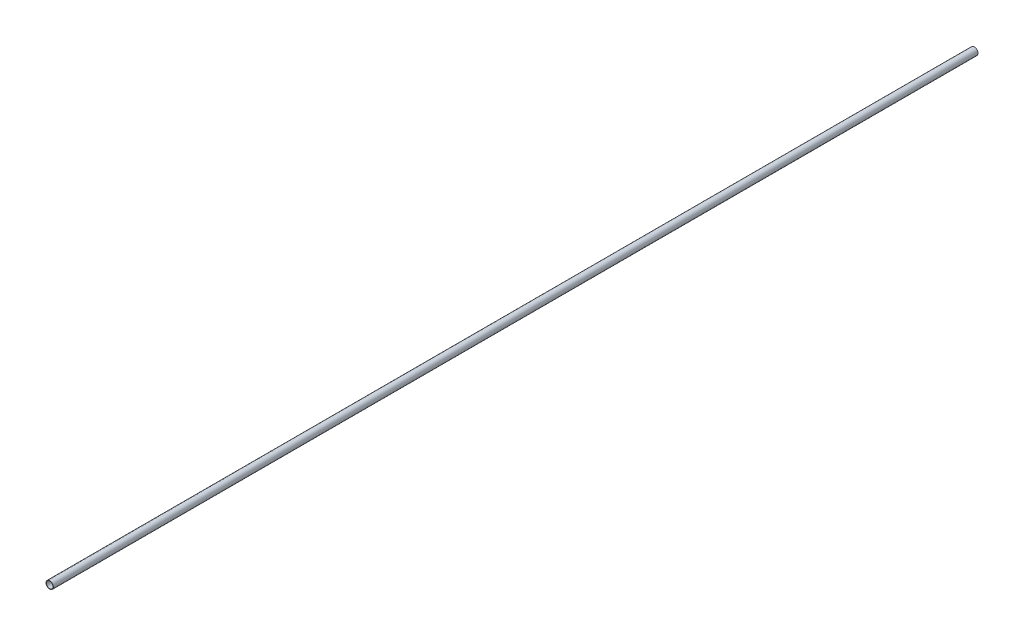
ISO-10303-21;
HEADER;
FILE_DESCRIPTION(('STEP AP214'),'2;1');
FILE_NAME('part.step','',(''),(''),'','','');
FILE_SCHEMA(('AUTOMOTIVE_DESIGN { 1 0 10303 214 1 1 1 1 }'));
ENDSEC;
DATA;
#1=APPLICATION_CONTEXT('core data for automotive mechanical design processes');
#2=APPLICATION_PROTOCOL_DEFINITION('international standard','automotive_design',2000,#1);
#3=PRODUCT_CONTEXT('',#1,'mechanical');
#4=PRODUCT('Part','Part','',(#3));
#5=PRODUCT_RELATED_PRODUCT_CATEGORY('part','',(#4));
#6=PRODUCT_DEFINITION_FORMATION('','',#4);
#7=PRODUCT_DEFINITION_CONTEXT('part definition',#1,'design');
#8=PRODUCT_DEFINITION('design','',#6,#7);
#9=PRODUCT_DEFINITION_SHAPE('','',#8);
#10=(LENGTH_UNIT() NAMED_UNIT(*) SI_UNIT(.MILLI.,.METRE.));
#11=(NAMED_UNIT(*) PLANE_ANGLE_UNIT() SI_UNIT($,.RADIAN.));
#12=(NAMED_UNIT(*) SI_UNIT($,.STERADIAN.) SOLID_ANGLE_UNIT());
#13=UNCERTAINTY_MEASURE_WITH_UNIT(LENGTH_MEASURE(1.E-05),#10,'distance_accuracy_value','');
#14=(GEOMETRIC_REPRESENTATION_CONTEXT(3) GLOBAL_UNCERTAINTY_ASSIGNED_CONTEXT((#13)) GLOBAL_UNIT_ASSIGNED_CONTEXT((#10,
#11,#12)) REPRESENTATION_CONTEXT('',''));
#15=CARTESIAN_POINT('',(0.,0.,0.));
#16=DIRECTION('',(0.,0.,1.));
#17=DIRECTION('',(1.,0.,0.));
#18=AXIS2_PLACEMENT_3D('',#15,#16,#17);
#19=CARTESIAN_POINT('',(0.,0.,1000.));
#20=DIRECTION('',(0.,0.,1.));
#21=DIRECTION('',(1.,0.,0.));
#22=AXIS2_PLACEMENT_3D('',#19,#20,#21);
#23=PLANE('',#22);
#24=CARTESIAN_POINT('',(0.,0.,1000.));
#25=DIRECTION('',(0.,0.,1.));
#26=DIRECTION('',(1.,0.,0.));
#27=AXIS2_PLACEMENT_3D('',#24,#25,#26);
#28=CIRCLE('',#27,8.);
#29=CARTESIAN_POINT('',(8.,0.,1000.));
#30=VERTEX_POINT('',#29);
#31=EDGE_CURVE('E10',#30,#30,#28,.T.);
#32=ORIENTED_EDGE('',*,*,#31,.T.);
#33=EDGE_LOOP('',(#32));
#34=FACE_BOUND('',#33,.T.);
#35=CARTESIAN_POINT('',(0.,0.,1000.));
#36=DIRECTION('',(0.,0.,1.));
#37=DIRECTION('',(1.,0.,0.));
#38=AXIS2_PLACEMENT_3D('',#35,#36,#37);
#39=CIRCLE('',#38,7.);
#40=CARTESIAN_POINT('',(7.,0.,1000.));
#41=VERTEX_POINT('',#40);
#42=EDGE_CURVE('E50',#41,#41,#39,.T.);
#43=ORIENTED_EDGE('',*,*,#42,.F.);
#44=EDGE_LOOP('',(#43));
#45=FACE_BOUND('',#44,.T.);
#46=ADVANCED_FACE('F37',(#34,#45),#23,.T.);
#47=CARTESIAN_POINT('',(0.,0.,-1000.));
#48=DIRECTION('',(0.,0.,1.));
#49=DIRECTION('',(1.,0.,0.));
#50=AXIS2_PLACEMENT_3D('',#47,#48,#49);
#51=PLANE('',#50);
#52=CARTESIAN_POINT('',(0.,0.,-1000.));
#53=DIRECTION('',(0.,0.,1.));
#54=DIRECTION('',(1.,0.,0.));
#55=AXIS2_PLACEMENT_3D('',#52,#53,#54);
#56=CIRCLE('',#55,8.);
#57=CARTESIAN_POINT('',(8.,0.,-1000.));
#58=VERTEX_POINT('',#57);
#59=EDGE_CURVE('E41',#58,#58,#56,.T.);
#60=ORIENTED_EDGE('',*,*,#59,.F.);
#61=EDGE_LOOP('',(#60));
#62=FACE_BOUND('',#61,.T.);
#63=CARTESIAN_POINT('',(0.,0.,-1000.));
#64=DIRECTION('',(0.,0.,1.));
#65=DIRECTION('',(1.,0.,0.));
#66=AXIS2_PLACEMENT_3D('',#63,#64,#65);
#67=CIRCLE('',#66,7.);
#68=CARTESIAN_POINT('',(7.,0.,-1000.));
#69=VERTEX_POINT('',#68);
#70=EDGE_CURVE('E52',#69,#69,#67,.T.);
#71=ORIENTED_EDGE('',*,*,#70,.T.);
#72=EDGE_LOOP('',(#71));
#73=FACE_BOUND('',#72,.T.);
#74=ADVANCED_FACE('F64',(#62,#73),#51,.F.);
#75=CARTESIAN_POINT('',(0.,0.,1000.));
#76=DIRECTION('',(0.,0.,-1.));
#77=DIRECTION('',(-1.,0.,0.));
#78=AXIS2_PLACEMENT_3D('',#75,#76,#77);
#79=CYLINDRICAL_SURFACE('',#78,8.);
#80=ORIENTED_EDGE('',*,*,#31,.F.);
#81=EDGE_LOOP('',(#80));
#82=FACE_BOUND('',#81,.T.);
#83=ORIENTED_EDGE('',*,*,#59,.T.);
#84=EDGE_LOOP('',(#83));
#85=FACE_BOUND('',#84,.T.);
#86=ADVANCED_FACE('F39',(#82,#85),#79,.T.);
#87=CARTESIAN_POINT('',(0.,0.,1000.));
#88=DIRECTION('',(0.,0.,-1.));
#89=DIRECTION('',(-1.,0.,0.));
#90=AXIS2_PLACEMENT_3D('',#87,#88,#89);
#91=CYLINDRICAL_SURFACE('',#90,7.);
#92=ORIENTED_EDGE('',*,*,#42,.T.);
#93=EDGE_LOOP('',(#92));
#94=FACE_BOUND('',#93,.T.);
#95=ORIENTED_EDGE('',*,*,#70,.F.);
#96=EDGE_LOOP('',(#95));
#97=FACE_BOUND('',#96,.T.);
#98=ADVANCED_FACE('F60',(#94,#97),#91,.F.);
#99=CLOSED_SHELL('',(#46,#74,#86,#98));
#100=MANIFOLD_SOLID_BREP('B2',#99);
#101=ADVANCED_BREP_SHAPE_REPRESENTATION('',(#18,#100),#14);
#102=SHAPE_DEFINITION_REPRESENTATION(#9,#101);
ENDSEC;
END-ISO-10303-21;
